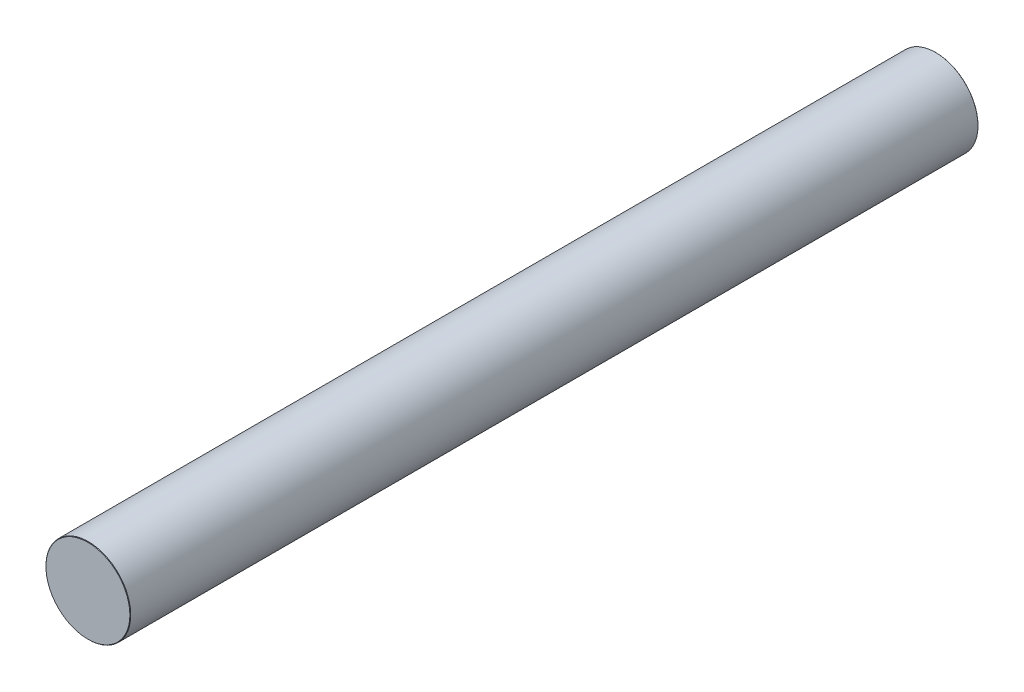
ISO-10303-21;
HEADER;
FILE_DESCRIPTION(('STEP AP214'),'2;1');
FILE_NAME('part.step','',(''),(''),'','','');
FILE_SCHEMA(('AUTOMOTIVE_DESIGN { 1 0 10303 214 1 1 1 1 }'));
ENDSEC;
DATA;
#1=APPLICATION_CONTEXT('core data for automotive mechanical design processes');
#2=APPLICATION_PROTOCOL_DEFINITION('international standard','automotive_design',2000,#1);
#3=PRODUCT_CONTEXT('',#1,'mechanical');
#4=PRODUCT('Part','Part','',(#3));
#5=PRODUCT_RELATED_PRODUCT_CATEGORY('part','',(#4));
#6=PRODUCT_DEFINITION_FORMATION('','',#4);
#7=PRODUCT_DEFINITION_CONTEXT('part definition',#1,'design');
#8=PRODUCT_DEFINITION('design','',#6,#7);
#9=PRODUCT_DEFINITION_SHAPE('','',#8);
#10=(LENGTH_UNIT() NAMED_UNIT(*) SI_UNIT(.MILLI.,.METRE.));
#11=(NAMED_UNIT(*) PLANE_ANGLE_UNIT() SI_UNIT($,.RADIAN.));
#12=(NAMED_UNIT(*) SI_UNIT($,.STERADIAN.) SOLID_ANGLE_UNIT());
#13=UNCERTAINTY_MEASURE_WITH_UNIT(LENGTH_MEASURE(1.E-05),#10,'distance_accuracy_value','');
#14=(GEOMETRIC_REPRESENTATION_CONTEXT(3) GLOBAL_UNCERTAINTY_ASSIGNED_CONTEXT((#13)) GLOBAL_UNIT_ASSIGNED_CONTEXT((#10,
#11,#12)) REPRESENTATION_CONTEXT('',''));
#15=CARTESIAN_POINT('',(0.,0.,0.));
#16=DIRECTION('',(0.,0.,1.));
#17=DIRECTION('',(1.,0.,0.));
#18=AXIS2_PLACEMENT_3D('',#15,#16,#17);
#19=CARTESIAN_POINT('',(0.,0.,200.));
#20=DIRECTION('',(0.,0.,-1.));
#21=DIRECTION('',(-1.,0.,0.));
#22=AXIS2_PLACEMENT_3D('',#19,#20,#21);
#23=CYLINDRICAL_SURFACE('',#22,10.);
#24=CARTESIAN_POINT('',(0.,0.,0.100000000000017));
#25=DIRECTION('',(0.,0.,1.));
#26=DIRECTION('',(1.,0.,0.));
#27=AXIS2_PLACEMENT_3D('',#24,#25,#26);
#28=CIRCLE('',#27,10.);
#29=CARTESIAN_POINT('',(10.,0.,0.100000000000017));
#30=VERTEX_POINT('',#29);
#31=EDGE_CURVE('E45',#30,#30,#28,.T.);
#32=ORIENTED_EDGE('',*,*,#31,.T.);
#33=EDGE_LOOP('',(#32));
#34=FACE_BOUND('',#33,.T.);
#35=CARTESIAN_POINT('',(0.,0.,199.9));
#36=DIRECTION('',(0.,0.,1.));
#37=DIRECTION('',(1.,0.,0.));
#38=AXIS2_PLACEMENT_3D('',#35,#36,#37);
#39=CIRCLE('',#38,10.);
#40=CARTESIAN_POINT('',(10.,0.,199.9));
#41=VERTEX_POINT('',#40);
#42=EDGE_CURVE('E49',#41,#41,#39,.F.);
#43=ORIENTED_EDGE('',*,*,#42,.T.);
#44=EDGE_LOOP('',(#43));
#45=FACE_BOUND('',#44,.T.);
#46=ADVANCED_FACE('F34',(#34,#45),#23,.T.);
#47=CARTESIAN_POINT('',(0.,0.,200.));
#48=DIRECTION('',(0.,0.,1.));
#49=DIRECTION('',(1.,0.,0.));
#50=AXIS2_PLACEMENT_3D('',#47,#48,#49);
#51=PLANE('',#50);
#52=CARTESIAN_POINT('',(0.,0.,200.));
#53=DIRECTION('',(0.,0.,1.));
#54=DIRECTION('',(1.,0.,0.));
#55=AXIS2_PLACEMENT_3D('',#52,#53,#54);
#56=CIRCLE('',#55,9.90000000000005);
#57=CARTESIAN_POINT('',(9.90000000000005,0.,200.));
#58=VERTEX_POINT('',#57);
#59=EDGE_CURVE('E10',#58,#58,#56,.T.);
#60=ORIENTED_EDGE('',*,*,#59,.T.);
#61=EDGE_LOOP('',(#60));
#62=FACE_BOUND('',#61,.T.);
#63=ADVANCED_FACE('F65',(#62),#51,.T.);
#64=CARTESIAN_POINT('',(0.,0.,0.));
#65=DIRECTION('',(0.,0.,1.));
#66=DIRECTION('',(1.,0.,0.));
#67=AXIS2_PLACEMENT_3D('',#64,#65,#66);
#68=PLANE('',#67);
#69=CARTESIAN_POINT('',(0.,0.,0.));
#70=DIRECTION('',(0.,0.,1.));
#71=DIRECTION('',(1.,0.,0.));
#72=AXIS2_PLACEMENT_3D('',#69,#70,#71);
#73=CIRCLE('',#72,9.89999999999996);
#74=CARTESIAN_POINT('',(9.89999999999996,0.,0.));
#75=VERTEX_POINT('',#74);
#76=EDGE_CURVE('E41',#75,#75,#73,.F.);
#77=ORIENTED_EDGE('',*,*,#76,.T.);
#78=EDGE_LOOP('',(#77));
#79=FACE_BOUND('',#78,.T.);
#80=ADVANCED_FACE('F62',(#79),#68,.F.);
#81=CARTESIAN_POINT('',(0.,0.,0.100000000000017));
#82=DIRECTION('',(0.,0.,1.));
#83=DIRECTION('',(1.,0.,0.));
#84=AXIS2_PLACEMENT_3D('',#81,#82,#83);
#85=CONICAL_SURFACE('',#84,10.,0.785398163397544);
#86=ORIENTED_EDGE('',*,*,#76,.F.);
#87=EDGE_LOOP('',(#86));
#88=FACE_BOUND('',#87,.T.);
#89=ORIENTED_EDGE('',*,*,#31,.F.);
#90=EDGE_LOOP('',(#89));
#91=FACE_BOUND('',#90,.T.);
#92=ADVANCED_FACE('F58',(#88,#91),#85,.T.);
#93=CARTESIAN_POINT('',(0.,0.,200.));
#94=DIRECTION('',(0.,0.,-1.));
#95=DIRECTION('',(-1.,0.,0.));
#96=AXIS2_PLACEMENT_3D('',#93,#94,#95);
#97=CONICAL_SURFACE('',#96,9.90000000000005,0.785398163397405);
#98=ORIENTED_EDGE('',*,*,#42,.F.);
#99=EDGE_LOOP('',(#98));
#100=FACE_BOUND('',#99,.T.);
#101=ORIENTED_EDGE('',*,*,#59,.F.);
#102=EDGE_LOOP('',(#101));
#103=FACE_BOUND('',#102,.T.);
#104=ADVANCED_FACE('F36',(#100,#103),#97,.T.);
#105=CLOSED_SHELL('',(#46,#63,#80,#92,#104));
#106=MANIFOLD_SOLID_BREP('B2',#105);
#107=ADVANCED_BREP_SHAPE_REPRESENTATION('',(#18,#106),#14);
#108=SHAPE_DEFINITION_REPRESENTATION(#9,#107);
ENDSEC;
END-ISO-10303-21;
